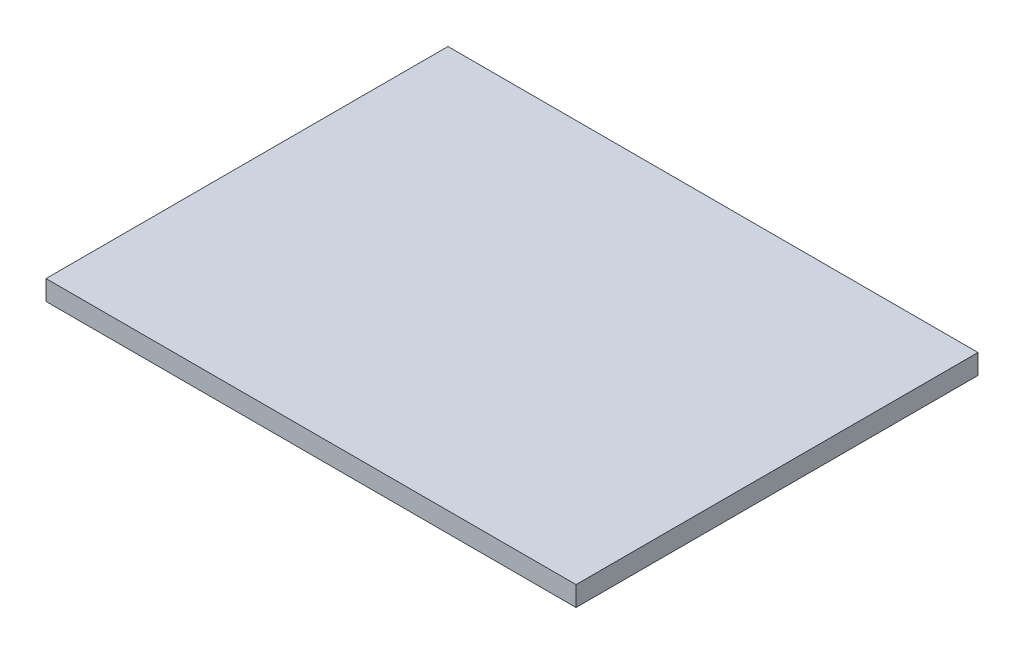
ISO-10303-21;
HEADER;
FILE_DESCRIPTION(('STEP AP214'),'2;1');
FILE_NAME('part.step','',(''),(''),'','','');
FILE_SCHEMA(('AUTOMOTIVE_DESIGN { 1 0 10303 214 1 1 1 1 }'));
ENDSEC;
DATA;
#1=APPLICATION_CONTEXT('core data for automotive mechanical design processes');
#2=APPLICATION_PROTOCOL_DEFINITION('international standard','automotive_design',2000,#1);
#3=PRODUCT_CONTEXT('',#1,'mechanical');
#4=PRODUCT('Part','Part','',(#3));
#5=PRODUCT_RELATED_PRODUCT_CATEGORY('part','',(#4));
#6=PRODUCT_DEFINITION_FORMATION('','',#4);
#7=PRODUCT_DEFINITION_CONTEXT('part definition',#1,'design');
#8=PRODUCT_DEFINITION('design','',#6,#7);
#9=PRODUCT_DEFINITION_SHAPE('','',#8);
#10=(LENGTH_UNIT() NAMED_UNIT(*) SI_UNIT(.MILLI.,.METRE.));
#11=(NAMED_UNIT(*) PLANE_ANGLE_UNIT() SI_UNIT($,.RADIAN.));
#12=(NAMED_UNIT(*) SI_UNIT($,.STERADIAN.) SOLID_ANGLE_UNIT());
#13=UNCERTAINTY_MEASURE_WITH_UNIT(LENGTH_MEASURE(1.E-05),#10,'distance_accuracy_value','');
#14=(GEOMETRIC_REPRESENTATION_CONTEXT(3) GLOBAL_UNCERTAINTY_ASSIGNED_CONTEXT((#13)) GLOBAL_UNIT_ASSIGNED_CONTEXT((#10,
#11,#12)) REPRESENTATION_CONTEXT('',''));
#15=CARTESIAN_POINT('',(0.,0.,0.));
#16=DIRECTION('',(0.,0.,1.));
#17=DIRECTION('',(1.,0.,0.));
#18=AXIS2_PLACEMENT_3D('',#15,#16,#17);
#19=CARTESIAN_POINT('',(441.575632917722,18.,17.0557139599908));
#20=DIRECTION('',(-1.,0.,0.));
#21=DIRECTION('',(0.,0.,1.));
#22=AXIS2_PLACEMENT_3D('',#19,#20,#21);
#23=PLANE('',#22);
#24=DIRECTION('',(0.,0.,-1.));
#25=VECTOR('',#24,1.);
#26=CARTESIAN_POINT('',(441.575632917722,0.,17.0557139599908));
#27=LINE('',#26,#25);
#28=CARTESIAN_POINT('',(441.575632917722,0.,17.0557139599908));
#29=VERTEX_POINT('',#28);
#30=CARTESIAN_POINT('',(441.575632917722,0.,-346.944286040009));
#31=VERTEX_POINT('',#30);
#32=EDGE_CURVE('E96',#29,#31,#27,.T.);
#33=ORIENTED_EDGE('',*,*,#32,.T.);
#34=DIRECTION('',(0.,-1.,0.));
#35=VECTOR('',#34,1.);
#36=CARTESIAN_POINT('',(441.575632917722,18.,-346.944286040009));
#37=LINE('',#36,#35);
#38=CARTESIAN_POINT('',(441.575632917722,18.,-346.944286040009));
#39=VERTEX_POINT('',#38);
#40=EDGE_CURVE('E11',#39,#31,#37,.T.);
#41=ORIENTED_EDGE('',*,*,#40,.F.);
#42=DIRECTION('',(0.,0.,-1.));
#43=VECTOR('',#42,1.);
#44=CARTESIAN_POINT('',(441.575632917722,18.,17.0557139599908));
#45=LINE('',#44,#43);
#46=CARTESIAN_POINT('',(441.575632917722,18.,17.0557139599908));
#47=VERTEX_POINT('',#46);
#48=EDGE_CURVE('E84',#47,#39,#45,.T.);
#49=ORIENTED_EDGE('',*,*,#48,.F.);
#50=DIRECTION('',(0.,-1.,0.));
#51=VECTOR('',#50,1.);
#52=CARTESIAN_POINT('',(441.575632917722,18.,17.0557139599908));
#53=LINE('',#52,#51);
#54=EDGE_CURVE('E92',#47,#29,#53,.T.);
#55=ORIENTED_EDGE('',*,*,#54,.T.);
#56=EDGE_LOOP('',(#33,#41,#49,#55));
#57=FACE_BOUND('',#56,.T.);
#58=ADVANCED_FACE('F33',(#57),#23,.F.);
#59=CARTESIAN_POINT('',(441.575632917722,18.,-346.944286040009));
#60=DIRECTION('',(0.,0.,1.));
#61=DIRECTION('',(1.,0.,0.));
#62=AXIS2_PLACEMENT_3D('',#59,#60,#61);
#63=PLANE('',#62);
#64=DIRECTION('',(-1.,0.,0.));
#65=VECTOR('',#64,1.);
#66=CARTESIAN_POINT('',(441.575632917722,0.,-346.944286040009));
#67=LINE('',#66,#65);
#68=CARTESIAN_POINT('',(-38.4243670822783,0.,-346.944286040009));
#69=VERTEX_POINT('',#68);
#70=EDGE_CURVE('E88',#31,#69,#67,.T.);
#71=ORIENTED_EDGE('',*,*,#70,.T.);
#72=DIRECTION('',(0.,-1.,0.));
#73=VECTOR('',#72,1.);
#74=CARTESIAN_POINT('',(-38.4243670822783,18.,-346.944286040009));
#75=LINE('',#74,#73);
#76=CARTESIAN_POINT('',(-38.4243670822783,18.,-346.944286040009));
#77=VERTEX_POINT('',#76);
#78=EDGE_CURVE('E41',#77,#69,#75,.T.);
#79=ORIENTED_EDGE('',*,*,#78,.F.);
#80=DIRECTION('',(-1.,0.,0.));
#81=VECTOR('',#80,1.);
#82=CARTESIAN_POINT('',(441.575632917722,18.,-346.944286040009));
#83=LINE('',#82,#81);
#84=EDGE_CURVE('E79',#39,#77,#83,.T.);
#85=ORIENTED_EDGE('',*,*,#84,.F.);
#86=ORIENTED_EDGE('',*,*,#40,.T.);
#87=EDGE_LOOP('',(#71,#79,#85,#86));
#88=FACE_BOUND('',#87,.T.);
#89=ADVANCED_FACE('F87',(#88),#63,.F.);
#90=CARTESIAN_POINT('',(-38.4243670822783,18.,17.0557139599909));
#91=DIRECTION('',(1.,0.,0.));
#92=DIRECTION('',(0.,0.,-1.));
#93=AXIS2_PLACEMENT_3D('',#90,#91,#92);
#94=PLANE('',#93);
#95=DIRECTION('',(0.,0.,1.));
#96=VECTOR('',#95,1.);
#97=CARTESIAN_POINT('',(-38.4243670822783,0.,17.0557139599909));
#98=LINE('',#97,#96);
#99=CARTESIAN_POINT('',(-38.4243670822783,0.,17.0557139599909));
#100=VERTEX_POINT('',#99);
#101=EDGE_CURVE('E66',#69,#100,#98,.T.);
#102=ORIENTED_EDGE('',*,*,#101,.T.);
#103=DIRECTION('',(0.,-1.,0.));
#104=VECTOR('',#103,1.);
#105=CARTESIAN_POINT('',(-38.4243670822783,18.,17.0557139599909));
#106=LINE('',#105,#104);
#107=CARTESIAN_POINT('',(-38.4243670822783,18.,17.0557139599909));
#108=VERTEX_POINT('',#107);
#109=EDGE_CURVE('E89',#108,#100,#106,.T.);
#110=ORIENTED_EDGE('',*,*,#109,.F.);
#111=DIRECTION('',(0.,0.,1.));
#112=VECTOR('',#111,1.);
#113=CARTESIAN_POINT('',(-38.4243670822783,18.,17.0557139599909));
#114=LINE('',#113,#112);
#115=EDGE_CURVE('E82',#77,#108,#114,.T.);
#116=ORIENTED_EDGE('',*,*,#115,.F.);
#117=ORIENTED_EDGE('',*,*,#78,.T.);
#118=EDGE_LOOP('',(#102,#110,#116,#117));
#119=FACE_BOUND('',#118,.T.);
#120=ADVANCED_FACE('F90',(#119),#94,.F.);
#121=CARTESIAN_POINT('',(441.575632917722,18.,17.0557139599908));
#122=DIRECTION('',(0.,0.,-1.));
#123=DIRECTION('',(-1.,0.,0.));
#124=AXIS2_PLACEMENT_3D('',#121,#122,#123);
#125=PLANE('',#124);
#126=DIRECTION('',(1.,0.,0.));
#127=VECTOR('',#126,1.);
#128=CARTESIAN_POINT('',(441.575632917722,0.,17.0557139599908));
#129=LINE('',#128,#127);
#130=EDGE_CURVE('E72',#100,#29,#129,.T.);
#131=ORIENTED_EDGE('',*,*,#130,.T.);
#132=ORIENTED_EDGE('',*,*,#54,.F.);
#133=DIRECTION('',(1.,0.,0.));
#134=VECTOR('',#133,1.);
#135=CARTESIAN_POINT('',(441.575632917722,18.,17.0557139599908));
#136=LINE('',#135,#134);
#137=EDGE_CURVE('E49',#108,#47,#136,.T.);
#138=ORIENTED_EDGE('',*,*,#137,.F.);
#139=ORIENTED_EDGE('',*,*,#109,.T.);
#140=EDGE_LOOP('',(#131,#132,#138,#139));
#141=FACE_BOUND('',#140,.T.);
#142=ADVANCED_FACE('F103',(#141),#125,.F.);
#143=CARTESIAN_POINT('',(0.,18.,0.));
#144=DIRECTION('',(0.,1.,0.));
#145=DIRECTION('',(0.,0.,1.));
#146=AXIS2_PLACEMENT_3D('',#143,#144,#145);
#147=PLANE('',#146);
#148=ORIENTED_EDGE('',*,*,#48,.T.);
#149=ORIENTED_EDGE('',*,*,#84,.T.);
#150=ORIENTED_EDGE('',*,*,#115,.T.);
#151=ORIENTED_EDGE('',*,*,#137,.T.);
#152=EDGE_LOOP('',(#148,#149,#150,#151));
#153=FACE_BOUND('',#152,.T.);
#154=ADVANCED_FACE('F80',(#153),#147,.T.);
#155=CARTESIAN_POINT('',(0.,0.,0.));
#156=DIRECTION('',(0.,1.,0.));
#157=DIRECTION('',(0.,0.,1.));
#158=AXIS2_PLACEMENT_3D('',#155,#156,#157);
#159=PLANE('',#158);
#160=ORIENTED_EDGE('',*,*,#32,.F.);
#161=ORIENTED_EDGE('',*,*,#130,.F.);
#162=ORIENTED_EDGE('',*,*,#101,.F.);
#163=ORIENTED_EDGE('',*,*,#70,.F.);
#164=EDGE_LOOP('',(#160,#161,#162,#163));
#165=FACE_BOUND('',#164,.T.);
#166=ADVANCED_FACE('F106',(#165),#159,.F.);
#167=CLOSED_SHELL('',(#58,#89,#120,#142,#154,#166));
#168=MANIFOLD_SOLID_BREP('B2',#167);
#169=ADVANCED_BREP_SHAPE_REPRESENTATION('',(#18,#168),#14);
#170=SHAPE_DEFINITION_REPRESENTATION(#9,#169);
ENDSEC;
END-ISO-10303-21;
